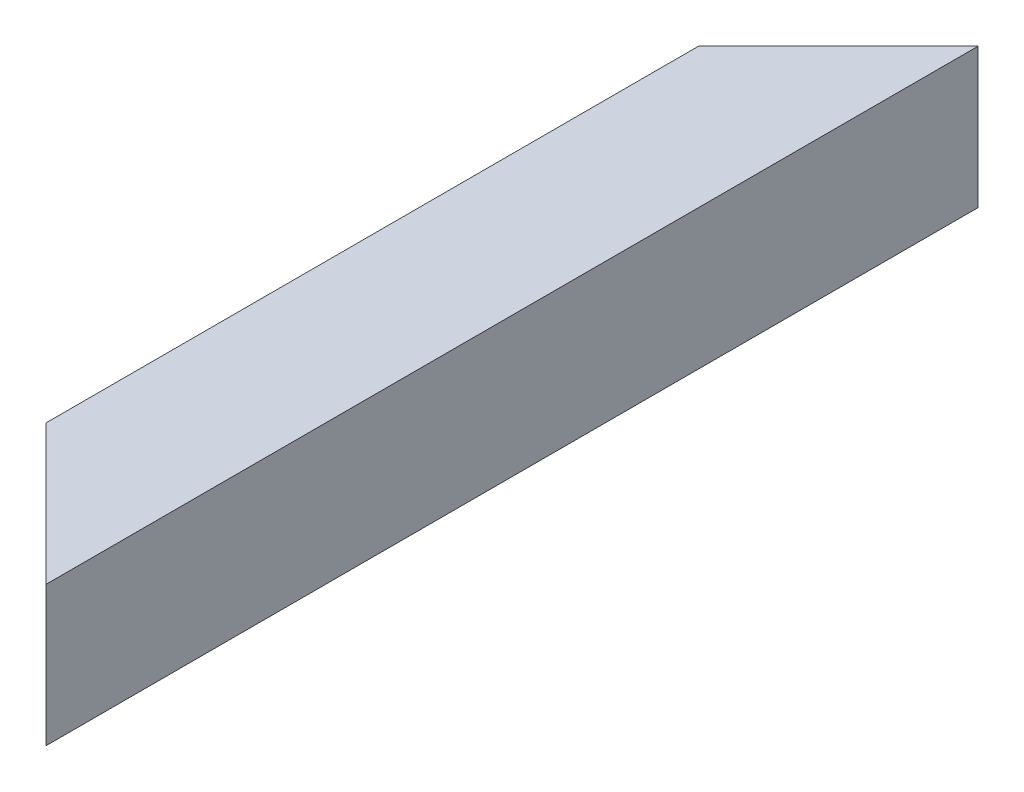
ISO-10303-21;
HEADER;
FILE_DESCRIPTION(('STEP AP214'),'2;1');
FILE_NAME('part.step','',(''),(''),'','','');
FILE_SCHEMA(('AUTOMOTIVE_DESIGN { 1 0 10303 214 1 1 1 1 }'));
ENDSEC;
DATA;
#1=APPLICATION_CONTEXT('core data for automotive mechanical design processes');
#2=APPLICATION_PROTOCOL_DEFINITION('international standard','automotive_design',2000,#1);
#3=PRODUCT_CONTEXT('',#1,'mechanical');
#4=PRODUCT('Part','Part','',(#3));
#5=PRODUCT_RELATED_PRODUCT_CATEGORY('part','',(#4));
#6=PRODUCT_DEFINITION_FORMATION('','',#4);
#7=PRODUCT_DEFINITION_CONTEXT('part definition',#1,'design');
#8=PRODUCT_DEFINITION('design','',#6,#7);
#9=PRODUCT_DEFINITION_SHAPE('','',#8);
#10=(LENGTH_UNIT() NAMED_UNIT(*) SI_UNIT(.MILLI.,.METRE.));
#11=(NAMED_UNIT(*) PLANE_ANGLE_UNIT() SI_UNIT($,.RADIAN.));
#12=(NAMED_UNIT(*) SI_UNIT($,.STERADIAN.) SOLID_ANGLE_UNIT());
#13=UNCERTAINTY_MEASURE_WITH_UNIT(LENGTH_MEASURE(1.E-05),#10,'distance_accuracy_value','');
#14=(GEOMETRIC_REPRESENTATION_CONTEXT(3) GLOBAL_UNCERTAINTY_ASSIGNED_CONTEXT((#13)) GLOBAL_UNIT_ASSIGNED_CONTEXT((#10,
#11,#12)) REPRESENTATION_CONTEXT('',''));
#15=CARTESIAN_POINT('',(0.,0.,0.));
#16=DIRECTION('',(0.,0.,1.));
#17=DIRECTION('',(1.,0.,0.));
#18=AXIS2_PLACEMENT_3D('',#15,#16,#17);
#19=CARTESIAN_POINT('',(-26.,26.,0.));
#20=DIRECTION('',(1.,0.,0.));
#21=DIRECTION('',(0.,0.,-1.));
#22=AXIS2_PLACEMENT_3D('',#19,#20,#21);
#23=PLANE('',#22);
#24=DIRECTION('',(0.,-1.,0.));
#25=VECTOR('',#24,1.);
#26=CARTESIAN_POINT('',(-26.,26.,55.9999999999994));
#27=LINE('',#26,#25);
#28=CARTESIAN_POINT('',(-26.,26.,55.9999999999994));
#29=VERTEX_POINT('',#28);
#30=CARTESIAN_POINT('',(-26.,-26.,55.9999999999994));
#31=VERTEX_POINT('',#30);
#32=EDGE_CURVE('E11',#29,#31,#27,.T.);
#33=ORIENTED_EDGE('',*,*,#32,.F.);
#34=DIRECTION('',(0.,0.,1.));
#35=VECTOR('',#34,1.);
#36=CARTESIAN_POINT('',(-26.,26.,0.));
#37=LINE('',#36,#35);
#38=CARTESIAN_POINT('',(-26.,26.,344.000000000001));
#39=VERTEX_POINT('',#38);
#40=EDGE_CURVE('E146',#29,#39,#37,.T.);
#41=ORIENTED_EDGE('',*,*,#40,.T.);
#42=DIRECTION('',(0.,1.,0.));
#43=VECTOR('',#42,1.);
#44=CARTESIAN_POINT('',(-26.,26.,344.000000000001));
#45=LINE('',#44,#43);
#46=CARTESIAN_POINT('',(-26.,-26.,344.000000000001));
#47=VERTEX_POINT('',#46);
#48=EDGE_CURVE('E44',#47,#39,#45,.T.);
#49=ORIENTED_EDGE('',*,*,#48,.F.);
#50=DIRECTION('',(0.,0.,1.));
#51=VECTOR('',#50,1.);
#52=CARTESIAN_POINT('',(-26.,-26.,0.));
#53=LINE('',#52,#51);
#54=EDGE_CURVE('E133',#31,#47,#53,.T.);
#55=ORIENTED_EDGE('',*,*,#54,.F.);
#56=EDGE_LOOP('',(#33,#41,#49,#55));
#57=FACE_BOUND('',#56,.T.);
#58=ADVANCED_FACE('F36',(#57),#23,.T.);
#59=CARTESIAN_POINT('',(-26.,-26.,0.));
#60=DIRECTION('',(0.,1.,0.));
#61=DIRECTION('',(0.,0.,1.));
#62=AXIS2_PLACEMENT_3D('',#59,#60,#61);
#63=PLANE('',#62);
#64=DIRECTION('',(0.707106781186551,0.,-0.707106781186544));
#65=VECTOR('',#64,1.);
#66=CARTESIAN_POINT('',(1.9999999999997,-26.,28.));
#67=LINE('',#66,#65);
#68=CARTESIAN_POINT('',(26.,-26.,3.99999999999995));
#69=VERTEX_POINT('',#68);
#70=EDGE_CURVE('E166',#31,#69,#67,.T.);
#71=ORIENTED_EDGE('',*,*,#70,.F.);
#72=ORIENTED_EDGE('',*,*,#54,.T.);
#73=DIRECTION('',(-0.707106781186551,0.,-0.707106781186544));
#74=VECTOR('',#73,1.);
#75=CARTESIAN_POINT('',(-198.,-26.,172.000000000002));
#76=LINE('',#75,#74);
#77=CARTESIAN_POINT('',(26.,-26.,396.));
#78=VERTEX_POINT('',#77);
#79=EDGE_CURVE('E58',#78,#47,#76,.T.);
#80=ORIENTED_EDGE('',*,*,#79,.F.);
#81=DIRECTION('',(0.,0.,1.));
#82=VECTOR('',#81,1.);
#83=CARTESIAN_POINT('',(26.,-26.,0.));
#84=LINE('',#83,#82);
#85=EDGE_CURVE('E136',#69,#78,#84,.T.);
#86=ORIENTED_EDGE('',*,*,#85,.F.);
#87=EDGE_LOOP('',(#71,#72,#80,#86));
#88=FACE_BOUND('',#87,.T.);
#89=ADVANCED_FACE('F182',(#88),#63,.T.);
#90=CARTESIAN_POINT('',(26.,26.,0.));
#91=DIRECTION('',(-1.,0.,0.));
#92=DIRECTION('',(0.,0.,1.));
#93=AXIS2_PLACEMENT_3D('',#90,#91,#92);
#94=PLANE('',#93);
#95=DIRECTION('',(0.,1.,0.));
#96=VECTOR('',#95,1.);
#97=CARTESIAN_POINT('',(26.,26.,3.99999999999995));
#98=LINE('',#97,#96);
#99=CARTESIAN_POINT('',(26.,26.,3.99999999999995));
#100=VERTEX_POINT('',#99);
#101=EDGE_CURVE('E168',#69,#100,#98,.T.);
#102=ORIENTED_EDGE('',*,*,#101,.F.);
#103=ORIENTED_EDGE('',*,*,#85,.T.);
#104=DIRECTION('',(0.,-1.,0.));
#105=VECTOR('',#104,1.);
#106=CARTESIAN_POINT('',(26.,26.,396.));
#107=LINE('',#106,#105);
#108=CARTESIAN_POINT('',(26.,26.,396.));
#109=VERTEX_POINT('',#108);
#110=EDGE_CURVE('E162',#109,#78,#107,.T.);
#111=ORIENTED_EDGE('',*,*,#110,.F.);
#112=DIRECTION('',(0.,0.,1.));
#113=VECTOR('',#112,1.);
#114=CARTESIAN_POINT('',(26.,26.,0.));
#115=LINE('',#114,#113);
#116=EDGE_CURVE('E142',#100,#109,#115,.T.);
#117=ORIENTED_EDGE('',*,*,#116,.F.);
#118=EDGE_LOOP('',(#102,#103,#111,#117));
#119=FACE_BOUND('',#118,.T.);
#120=ADVANCED_FACE('F179',(#119),#94,.T.);
#121=CARTESIAN_POINT('',(-26.,26.,0.));
#122=DIRECTION('',(0.,-1.,0.));
#123=DIRECTION('',(0.,0.,-1.));
#124=AXIS2_PLACEMENT_3D('',#121,#122,#123);
#125=PLANE('',#124);
#126=DIRECTION('',(-0.707106781186551,0.,0.707106781186544));
#127=VECTOR('',#126,1.);
#128=CARTESIAN_POINT('',(1.9999999999997,26.,28.));
#129=LINE('',#128,#127);
#130=EDGE_CURVE('E50',#100,#29,#129,.T.);
#131=ORIENTED_EDGE('',*,*,#130,.F.);
#132=ORIENTED_EDGE('',*,*,#116,.T.);
#133=DIRECTION('',(0.707106781186551,0.,0.707106781186544));
#134=VECTOR('',#133,1.);
#135=CARTESIAN_POINT('',(-198.,26.,172.000000000002));
#136=LINE('',#135,#134);
#137=EDGE_CURVE('E164',#39,#109,#136,.T.);
#138=ORIENTED_EDGE('',*,*,#137,.F.);
#139=ORIENTED_EDGE('',*,*,#40,.F.);
#140=EDGE_LOOP('',(#131,#132,#138,#139));
#141=FACE_BOUND('',#140,.T.);
#142=ADVANCED_FACE('F174',(#141),#125,.T.);
#143=CARTESIAN_POINT('',(30.,-30.,400.));
#144=DIRECTION('',(0.707106781186544,0.,-0.707106781186551));
#145=DIRECTION('',(-0.707106781186551,0.,-0.707106781186544));
#146=AXIS2_PLACEMENT_3D('',#143,#144,#145);
#147=PLANE('',#146);
#148=ORIENTED_EDGE('',*,*,#137,.T.);
#149=ORIENTED_EDGE('',*,*,#110,.T.);
#150=ORIENTED_EDGE('',*,*,#79,.T.);
#151=ORIENTED_EDGE('',*,*,#48,.T.);
#152=EDGE_LOOP('',(#148,#149,#150,#151));
#153=FACE_BOUND('',#152,.T.);
#154=DIRECTION('',(-0.707106781186551,0.,-0.707106781186543));
#155=VECTOR('',#154,1.);
#156=CARTESIAN_POINT('',(30.,30.,400.));
#157=LINE('',#156,#155);
#158=CARTESIAN_POINT('',(30.,30.,400.));
#159=VERTEX_POINT('',#158);
#160=CARTESIAN_POINT('',(-30.,30.,340.000000000001));
#161=VERTEX_POINT('',#160);
#162=EDGE_CURVE('E155',#159,#161,#157,.T.);
#163=ORIENTED_EDGE('',*,*,#162,.T.);
#164=DIRECTION('',(0.,1.,0.));
#165=VECTOR('',#164,1.);
#166=CARTESIAN_POINT('',(-30.,-30.,340.000000000001));
#167=LINE('',#166,#165);
#168=CARTESIAN_POINT('',(-30.,-30.,340.000000000001));
#169=VERTEX_POINT('',#168);
#170=EDGE_CURVE('E157',#169,#161,#167,.T.);
#171=ORIENTED_EDGE('',*,*,#170,.F.);
#172=DIRECTION('',(-0.707106781186551,0.,-0.707106781186543));
#173=VECTOR('',#172,1.);
#174=CARTESIAN_POINT('',(30.,-30.,400.));
#175=LINE('',#174,#173);
#176=CARTESIAN_POINT('',(30.,-30.,400.));
#177=VERTEX_POINT('',#176);
#178=EDGE_CURVE('E123',#177,#169,#175,.T.);
#179=ORIENTED_EDGE('',*,*,#178,.F.);
#180=DIRECTION('',(0.,1.,0.));
#181=VECTOR('',#180,1.);
#182=CARTESIAN_POINT('',(30.,30.,400.));
#183=LINE('',#182,#181);
#184=EDGE_CURVE('E145',#177,#159,#183,.T.);
#185=ORIENTED_EDGE('',*,*,#184,.T.);
#186=EDGE_LOOP('',(#163,#171,#179,#185));
#187=FACE_BOUND('',#186,.T.);
#188=ADVANCED_FACE('F181',(#153,#187),#147,.F.);
#189=CARTESIAN_POINT('',(30.,-30.,0.));
#190=DIRECTION('',(0.707106781186544,0.,0.707106781186551));
#191=DIRECTION('',(0.707106781186551,0.,-0.707106781186544));
#192=AXIS2_PLACEMENT_3D('',#189,#190,#191);
#193=PLANE('',#192);
#194=ORIENTED_EDGE('',*,*,#130,.T.);
#195=ORIENTED_EDGE('',*,*,#32,.T.);
#196=ORIENTED_EDGE('',*,*,#70,.T.);
#197=ORIENTED_EDGE('',*,*,#101,.T.);
#198=EDGE_LOOP('',(#194,#195,#196,#197));
#199=FACE_BOUND('',#198,.T.);
#200=DIRECTION('',(0.707106781186551,0.,-0.707106781186544));
#201=VECTOR('',#200,1.);
#202=CARTESIAN_POINT('',(30.,30.,0.));
#203=LINE('',#202,#201);
#204=CARTESIAN_POINT('',(-30.,30.,59.9999999999994));
#205=VERTEX_POINT('',#204);
#206=CARTESIAN_POINT('',(30.,30.,0.));
#207=VERTEX_POINT('',#206);
#208=EDGE_CURVE('E110',#205,#207,#203,.T.);
#209=ORIENTED_EDGE('',*,*,#208,.T.);
#210=DIRECTION('',(0.,1.,0.));
#211=VECTOR('',#210,1.);
#212=CARTESIAN_POINT('',(30.,30.,0.));
#213=LINE('',#212,#211);
#214=CARTESIAN_POINT('',(30.,-30.,0.));
#215=VERTEX_POINT('',#214);
#216=EDGE_CURVE('E105',#215,#207,#213,.T.);
#217=ORIENTED_EDGE('',*,*,#216,.F.);
#218=DIRECTION('',(0.707106781186551,0.,-0.707106781186544));
#219=VECTOR('',#218,1.);
#220=CARTESIAN_POINT('',(30.,-30.,0.));
#221=LINE('',#220,#219);
#222=CARTESIAN_POINT('',(-30.,-30.,59.9999999999994));
#223=VERTEX_POINT('',#222);
#224=EDGE_CURVE('E99',#223,#215,#221,.T.);
#225=ORIENTED_EDGE('',*,*,#224,.F.);
#226=DIRECTION('',(0.,1.,0.));
#227=VECTOR('',#226,1.);
#228=CARTESIAN_POINT('',(-30.,-30.,59.9999999999994));
#229=LINE('',#228,#227);
#230=EDGE_CURVE('E102',#223,#205,#229,.T.);
#231=ORIENTED_EDGE('',*,*,#230,.T.);
#232=EDGE_LOOP('',(#209,#217,#225,#231));
#233=FACE_BOUND('',#232,.T.);
#234=ADVANCED_FACE('F101',(#199,#233),#193,.F.);
#235=CARTESIAN_POINT('',(-30.,30.,0.));
#236=DIRECTION('',(-1.,0.,0.));
#237=DIRECTION('',(0.,0.,1.));
#238=AXIS2_PLACEMENT_3D('',#235,#236,#237);
#239=PLANE('',#238);
#240=ORIENTED_EDGE('',*,*,#230,.F.);
#241=DIRECTION('',(0.,0.,1.));
#242=VECTOR('',#241,1.);
#243=CARTESIAN_POINT('',(-30.,-30.,0.));
#244=LINE('',#243,#242);
#245=EDGE_CURVE('E117',#223,#169,#244,.T.);
#246=ORIENTED_EDGE('',*,*,#245,.T.);
#247=ORIENTED_EDGE('',*,*,#170,.T.);
#248=DIRECTION('',(0.,0.,1.));
#249=VECTOR('',#248,1.);
#250=CARTESIAN_POINT('',(-30.,30.,0.));
#251=LINE('',#250,#249);
#252=EDGE_CURVE('E119',#205,#161,#251,.T.);
#253=ORIENTED_EDGE('',*,*,#252,.F.);
#254=EDGE_LOOP('',(#240,#246,#247,#253));
#255=FACE_BOUND('',#254,.T.);
#256=ADVANCED_FACE('F115',(#255),#239,.T.);
#257=CARTESIAN_POINT('',(-30.,-30.,0.));
#258=DIRECTION('',(0.,-1.,0.));
#259=DIRECTION('',(0.,0.,-1.));
#260=AXIS2_PLACEMENT_3D('',#257,#258,#259);
#261=PLANE('',#260);
#262=ORIENTED_EDGE('',*,*,#224,.T.);
#263=DIRECTION('',(0.,0.,1.));
#264=VECTOR('',#263,1.);
#265=CARTESIAN_POINT('',(30.,-30.,0.));
#266=LINE('',#265,#264);
#267=EDGE_CURVE('E124',#215,#177,#266,.T.);
#268=ORIENTED_EDGE('',*,*,#267,.T.);
#269=ORIENTED_EDGE('',*,*,#178,.T.);
#270=ORIENTED_EDGE('',*,*,#245,.F.);
#271=EDGE_LOOP('',(#262,#268,#269,#270));
#272=FACE_BOUND('',#271,.T.);
#273=ADVANCED_FACE('F122',(#272),#261,.T.);
#274=CARTESIAN_POINT('',(30.,30.,0.));
#275=DIRECTION('',(1.,0.,0.));
#276=DIRECTION('',(0.,0.,-1.));
#277=AXIS2_PLACEMENT_3D('',#274,#275,#276);
#278=PLANE('',#277);
#279=DIRECTION('',(0.,0.,1.));
#280=VECTOR('',#279,1.);
#281=CARTESIAN_POINT('',(30.,30.,0.));
#282=LINE('',#281,#280);
#283=EDGE_CURVE('E126',#207,#159,#282,.T.);
#284=ORIENTED_EDGE('',*,*,#283,.T.);
#285=ORIENTED_EDGE('',*,*,#184,.F.);
#286=ORIENTED_EDGE('',*,*,#267,.F.);
#287=ORIENTED_EDGE('',*,*,#216,.T.);
#288=EDGE_LOOP('',(#284,#285,#286,#287));
#289=FACE_BOUND('',#288,.T.);
#290=ADVANCED_FACE('F153',(#289),#278,.T.);
#291=CARTESIAN_POINT('',(-30.,30.,0.));
#292=DIRECTION('',(0.,1.,0.));
#293=DIRECTION('',(0.,0.,1.));
#294=AXIS2_PLACEMENT_3D('',#291,#292,#293);
#295=PLANE('',#294);
#296=ORIENTED_EDGE('',*,*,#208,.F.);
#297=ORIENTED_EDGE('',*,*,#252,.T.);
#298=ORIENTED_EDGE('',*,*,#162,.F.);
#299=ORIENTED_EDGE('',*,*,#283,.F.);
#300=EDGE_LOOP('',(#296,#297,#298,#299));
#301=FACE_BOUND('',#300,.T.);
#302=ADVANCED_FACE('F38',(#301),#295,.T.);
#303=CLOSED_SHELL('',(#58,#89,#120,#142,#188,#234,#256,#273,#290,#302));
#304=MANIFOLD_SOLID_BREP('B2',#303);
#305=ADVANCED_BREP_SHAPE_REPRESENTATION('',(#18,#304),#14);
#306=SHAPE_DEFINITION_REPRESENTATION(#9,#305);
ENDSEC;
END-ISO-10303-21;
